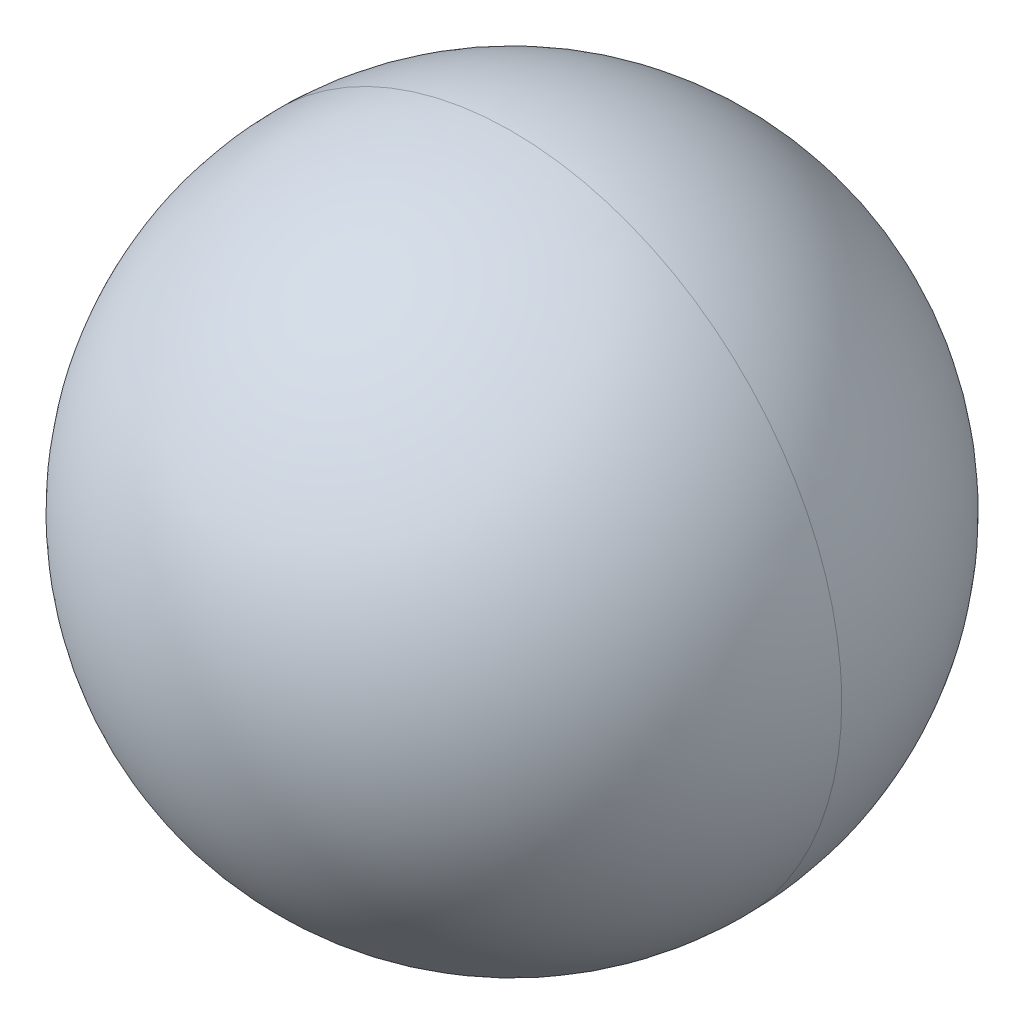
ISO-10303-21;
HEADER;
FILE_DESCRIPTION(('STEP AP214'),'2;1');
FILE_NAME('part.step','',(''),(''),'','','');
FILE_SCHEMA(('AUTOMOTIVE_DESIGN { 1 0 10303 214 1 1 1 1 }'));
ENDSEC;
DATA;
#1=APPLICATION_CONTEXT('core data for automotive mechanical design processes');
#2=APPLICATION_PROTOCOL_DEFINITION('international standard','automotive_design',2000,#1);
#3=PRODUCT_CONTEXT('',#1,'mechanical');
#4=PRODUCT('Part','Part','',(#3));
#5=PRODUCT_RELATED_PRODUCT_CATEGORY('part','',(#4));
#6=PRODUCT_DEFINITION_FORMATION('','',#4);
#7=PRODUCT_DEFINITION_CONTEXT('part definition',#1,'design');
#8=PRODUCT_DEFINITION('design','',#6,#7);
#9=PRODUCT_DEFINITION_SHAPE('','',#8);
#10=(LENGTH_UNIT() NAMED_UNIT(*) SI_UNIT(.MILLI.,.METRE.));
#11=(NAMED_UNIT(*) PLANE_ANGLE_UNIT() SI_UNIT($,.RADIAN.));
#12=(NAMED_UNIT(*) SI_UNIT($,.STERADIAN.) SOLID_ANGLE_UNIT());
#13=UNCERTAINTY_MEASURE_WITH_UNIT(LENGTH_MEASURE(1.E-05),#10,'distance_accuracy_value','');
#14=(GEOMETRIC_REPRESENTATION_CONTEXT(3) GLOBAL_UNCERTAINTY_ASSIGNED_CONTEXT((#13)) GLOBAL_UNIT_ASSIGNED_CONTEXT((#10,
#11,#12)) REPRESENTATION_CONTEXT('',''));
#15=CARTESIAN_POINT('',(0.,0.,0.));
#16=DIRECTION('',(0.,0.,1.));
#17=DIRECTION('',(1.,0.,0.));
#18=AXIS2_PLACEMENT_3D('',#15,#16,#17);
#19=CARTESIAN_POINT('',(3.5,15.375,0.));
#20=DIRECTION('',(1.,0.,0.));
#21=DIRECTION('',(0.,0.,1.));
#22=AXIS2_PLACEMENT_3D('',#19,#20,#21);
#23=SPHERICAL_SURFACE('',#22,1.75);
#24=CARTESIAN_POINT('',(3.5,15.375,0.));
#25=DIRECTION('',(0.,0.,1.));
#26=DIRECTION('',(0.,-1.,0.));
#27=AXIS2_PLACEMENT_3D('',#24,#25,#26);
#28=CIRCLE('',#27,1.75);
#29=CARTESIAN_POINT('',(1.75,15.375,0.));
#30=VERTEX_POINT('',#29);
#31=CARTESIAN_POINT('',(5.25,15.375,0.));
#32=VERTEX_POINT('',#31);
#33=EDGE_CURVE('E10',#30,#32,#28,.T.);
#34=ORIENTED_EDGE('',*,*,#33,.F.);
#35=CARTESIAN_POINT('',(1.75,15.375,0.));
#36=CARTESIAN_POINT('',(1.74999939259464,15.4036343369566,0.));
#37=CARTESIAN_POINT('',(1.75070277003098,15.4322686222289,0.));
#38=CARTESIAN_POINT('',(1.75351313325091,15.4894682379171,0.));
#39=CARTESIAN_POINT('',(1.75562011903451,15.518033568333,0.));
#40=CARTESIAN_POINT('',(1.7612333376128,15.5750264228205,0.));
#41=CARTESIAN_POINT('',(1.76473957040751,15.603453946892,0.));
#42=CARTESIAN_POINT('',(1.77314264471575,15.6601027137017,0.));
#43=CARTESIAN_POINT('',(1.77803948622929,15.6883239564399,0.));
#44=CARTESIAN_POINT('',(1.7892120323594,15.7444921706166,0.));
#45=CARTESIAN_POINT('',(1.79548773697598,15.7724391420552,0.));
#46=CARTESIAN_POINT('',(1.80940287684311,15.8279914876062,0.));
#47=CARTESIAN_POINT('',(1.81704231209367,15.8555968617186,0.));
#48=CARTESIAN_POINT('',(1.8336665128436,15.910399508672,0.));
#49=CARTESIAN_POINT('',(1.84265127834296,15.937596781513,0.));
#50=CARTESIAN_POINT('',(1.86194449351646,15.9915177053597,0.));
#51=CARTESIAN_POINT('',(1.87225294319059,16.0182413563654,0.));
#52=CARTESIAN_POINT('',(1.8941686930199,16.0711506569124,0.));
#53=CARTESIAN_POINT('',(1.90577599317508,16.0973363064537,0.));
#54=CARTESIAN_POINT('',(1.93026148089287,16.1491065205522,0.));
#55=CARTESIAN_POINT('',(1.94313966845548,16.1746910851094,0.));
#56=CARTESIAN_POINT('',(1.97013590632528,16.2251974937816,0.));
#57=CARTESIAN_POINT('',(1.98425395663247,16.2501193378967,0.));
#58=CARTESIAN_POINT('',(2.01369590836657,16.2992402667796,0.));
#59=CARTESIAN_POINT('',(2.02901980979348,16.3234393515475,0.));
#60=CARTESIAN_POINT('',(2.06083654714761,16.3710564640211,0.));
#61=CARTESIAN_POINT('',(2.07732938307484,16.3944744917269,0.));
#62=CARTESIAN_POINT('',(2.1114442567429,16.4404730739966,0.));
#63=CARTESIAN_POINT('',(2.12906629448374,16.4630536285604,0.));
#64=CARTESIAN_POINT('',(2.16539711874668,16.5073228660123,0.));
#65=CARTESIAN_POINT('',(2.1841059052688,16.5290115489004,0.));
#66=CARTESIAN_POINT('',(2.22256515598884,16.5714447930641,0.));
#67=CARTESIAN_POINT('',(2.24231562018678,16.5921893543397,0.));
#68=CARTESIAN_POINT('',(2.2828106456603,16.6326843798132,0.));
#69=CARTESIAN_POINT('',(2.30355520693588,16.6524348440112,0.));
#70=CARTESIAN_POINT('',(2.34598845109955,16.6908940947312,0.));
#71=CARTESIAN_POINT('',(2.36767713398765,16.7096028812533,0.));
#72=CARTESIAN_POINT('',(2.41194637143958,16.7459337055163,0.));
#73=CARTESIAN_POINT('',(2.43452692600342,16.7635557432571,0.));
#74=CARTESIAN_POINT('',(2.48052550827306,16.7976706169251,0.));
#75=CARTESIAN_POINT('',(2.50394353597886,16.8141634528523,0.));
#76=CARTESIAN_POINT('',(2.55156064845252,16.8459801902066,0.));
#77=CARTESIAN_POINT('',(2.57575973322038,16.8613040916337,0.));
#78=CARTESIAN_POINT('',(2.62488066210334,16.8907460433672,0.));
#79=CARTESIAN_POINT('',(2.64980250621845,16.9048640936736,0.));
#80=CARTESIAN_POINT('',(2.70030891489055,16.9318603315457,0.));
#81=CARTESIAN_POINT('',(2.72589347944755,16.9447385191115,0.));
#82=CARTESIAN_POINT('',(2.77766369354646,16.9692240068206,0.));
#83=CARTESIAN_POINT('',(2.80384934308838,16.980831306964,0.));
#84=CARTESIAN_POINT('',(2.8567586436338,17.0027470568255,0.));
#85=CARTESIAN_POINT('',(2.88348229463731,17.0130555065438,0.));
#86=CARTESIAN_POINT('',(2.93740321848992,17.0323487215968,0.));
#87=CARTESIAN_POINT('',(2.96460049133903,17.0413334869316,0.));
#88=CARTESIAN_POINT('',(3.01940313827035,17.0579576881311,0.));
#89=CARTESIAN_POINT('',(3.04700851235257,17.0655971239958,0.));
#90=CARTESIAN_POINT('',(3.102560857986,17.0795122621851,0.));
#91=CARTESIAN_POINT('',(3.13050782953722,17.0857879645096,0.));
#92=CARTESIAN_POINT('',(3.18667604340632,17.0969605169017,0.));
#93=CARTESIAN_POINT('',(3.21489728572421,17.1018573669694,0.));
#94=CARTESIAN_POINT('',(3.27154605368202,17.1102604179073,0.));
#95=CARTESIAN_POINT('',(3.29997357932194,17.1137666187775,0.));
#96=CARTESIAN_POINT('',(3.35696642952459,17.1193799245752,0.));
#97=CARTESIAN_POINT('',(3.38553175408733,17.1214870295029,0.));
#98=CARTESIAN_POINT('',(3.4427313857667,17.1242970672152,0.));
#99=CARTESIAN_POINT('',(3.47136569288335,17.125,0.));
#100=CARTESIAN_POINT('',(3.52863430711664,17.125,0.));
#101=CARTESIAN_POINT('',(3.55726861423329,17.1242970672152,0.));
#102=CARTESIAN_POINT('',(3.61446824591267,17.1214870295029,0.));
#103=CARTESIAN_POINT('',(3.6430335704754,17.1193799245752,0.));
#104=CARTESIAN_POINT('',(3.70002642067805,17.1137666187775,0.));
#105=CARTESIAN_POINT('',(3.72845394631798,17.1102604179073,0.));
#106=CARTESIAN_POINT('',(3.78510271427578,17.1018573669694,0.));
#107=CARTESIAN_POINT('',(3.81332395659367,17.0969605169017,0.));
#108=CARTESIAN_POINT('',(3.86949217046277,17.0857879645096,0.));
#109=CARTESIAN_POINT('',(3.89743914201399,17.0795122621851,0.));
#110=CARTESIAN_POINT('',(3.95299148764743,17.0655971239958,0.));
#111=CARTESIAN_POINT('',(3.98059686172964,17.0579576881311,0.));
#112=CARTESIAN_POINT('',(4.03539950866097,17.0413334869316,0.));
#113=CARTESIAN_POINT('',(4.06259678151008,17.0323487215968,0.));
#114=CARTESIAN_POINT('',(4.11651770536269,17.0130555065438,0.));
#115=CARTESIAN_POINT('',(4.14324135636619,17.0027470568255,0.));
#116=CARTESIAN_POINT('',(4.19615065691161,16.980831306964,0.));
#117=CARTESIAN_POINT('',(4.22233630645353,16.9692240068206,0.));
#118=CARTESIAN_POINT('',(4.27410652055245,16.9447385191115,0.));
#119=CARTESIAN_POINT('',(4.29969108510944,16.9318603315457,0.));
#120=CARTESIAN_POINT('',(4.35019749378154,16.9048640936736,0.));
#121=CARTESIAN_POINT('',(4.37511933789665,16.8907460433672,0.));
#122=CARTESIAN_POINT('',(4.42424026677962,16.8613040916337,0.));
#123=CARTESIAN_POINT('',(4.44843935154747,16.8459801902066,0.));
#124=CARTESIAN_POINT('',(4.49605646402113,16.8141634528523,0.));
#125=CARTESIAN_POINT('',(4.51947449172694,16.7976706169251,0.));
#126=CARTESIAN_POINT('',(4.56547307399657,16.7635557432571,0.));
#127=CARTESIAN_POINT('',(4.58805362856041,16.7459337055163,0.));
#128=CARTESIAN_POINT('',(4.63232286601234,16.7096028812533,0.));
#129=CARTESIAN_POINT('',(4.65401154890044,16.6908940947312,0.));
#130=CARTESIAN_POINT('',(4.69644479306412,16.6524348440112,0.));
#131=CARTESIAN_POINT('',(4.7171893543397,16.6326843798132,0.));
#132=CARTESIAN_POINT('',(4.75768437981321,16.5921893543397,0.));
#133=CARTESIAN_POINT('',(4.77743484401115,16.5714447930641,0.));
#134=CARTESIAN_POINT('',(4.8158940947312,16.5290115489004,0.));
#135=CARTESIAN_POINT('',(4.83460288125331,16.5073228660123,0.));
#136=CARTESIAN_POINT('',(4.87093370551626,16.4630536285604,0.));
#137=CARTESIAN_POINT('',(4.8885557432571,16.4404730739966,0.));
#138=CARTESIAN_POINT('',(4.92267061692516,16.3944744917269,0.));
#139=CARTESIAN_POINT('',(4.93916345285239,16.3710564640211,0.));
#140=CARTESIAN_POINT('',(4.97098019020652,16.3234393515475,0.));
#141=CARTESIAN_POINT('',(4.98630409163342,16.2992402667796,0.));
#142=CARTESIAN_POINT('',(5.01574604336752,16.2501193378967,0.));
#143=CARTESIAN_POINT('',(5.02986409367472,16.2251974937816,0.));
#144=CARTESIAN_POINT('',(5.05686033154452,16.1746910851094,0.));
#145=CARTESIAN_POINT('',(5.06973851910713,16.1491065205522,0.));
#146=CARTESIAN_POINT('',(5.09422400682492,16.0973363064538,0.));
#147=CARTESIAN_POINT('',(5.1058313069801,16.0711506569124,0.));
#148=CARTESIAN_POINT('',(5.1277470568094,16.0182413563654,0.));
#149=CARTESIAN_POINT('',(5.13805550648354,15.9915177053597,0.));
#150=CARTESIAN_POINT('',(5.15734872165703,15.937596781513,0.));
#151=CARTESIAN_POINT('',(5.1663334871564,15.910399508672,0.));
#152=CARTESIAN_POINT('',(5.18295768790633,15.8555968617186,0.));
#153=CARTESIAN_POINT('',(5.19059712315688,15.8279914876062,0.));
#154=CARTESIAN_POINT('',(5.20451226302402,15.7724391420552,0.));
#155=CARTESIAN_POINT('',(5.2107879676406,15.7444921706166,0.));
#156=CARTESIAN_POINT('',(5.22196051377071,15.6883239564399,0.));
#157=CARTESIAN_POINT('',(5.22685735528425,15.6601027137017,0.));
#158=CARTESIAN_POINT('',(5.23526042959249,15.603453946892,0.));
#159=CARTESIAN_POINT('',(5.23876666238719,15.5750264228205,0.));
#160=CARTESIAN_POINT('',(5.24437988096549,15.518033568333,0.));
#161=CARTESIAN_POINT('',(5.24648686674909,15.4894682379171,0.));
#162=CARTESIAN_POINT('',(5.24929722996902,15.4322686222289,0.));
#163=CARTESIAN_POINT('',(5.25000060740536,15.4036343369566,0.));
#164=CARTESIAN_POINT('',(5.25,15.375,0.));
#165=B_SPLINE_CURVE_WITH_KNOTS('',3,(#35,#36,#37,#38,#39,#40,#41,#42,#43,#44,#45,#46,#47,#48,
#49,#50,#51,#52,#53,#54,#55,#56,#57,#58,#59,#60,#61,#62,#63,#64,#65,#66,#67,#68,#69,#70,#71,#72,
#73,#74,#75,#76,#77,#78,#79,#80,#81,#82,#83,#84,#85,#86,#87,#88,#89,#90,#91,#92,#93,#94,#95,#96,
#97,#98,#99,#100,#101,#102,#103,#104,#105,#106,#107,#108,#109,#110,#111,#112,#113,#114,#115,
#116,#117,#118,#119,#120,#121,#122,#123,#124,#125,#126,#127,#128,#129,#130,#131,#132,#133,#134,
#135,#136,#137,#138,#139,#140,#141,#142,#143,#144,#145,#146,#147,#148,#149,#150,#151,#152,#153,
#154,#155,#156,#157,#158,#159,#160,#161,#162,#163,#164),.UNSPECIFIED.,.F.,.F.,(4,2,2,2,2,2,2,2,
2,2,2,2,2,2,2,2,2,2,2,2,2,2,2,2,2,2,2,2,2,2,2,2,2,2,2,2,2,2,2,2,2,2,2,2,2,2,2,2,2,2,2,2,2,2,2,2,
2,2,2,2,2,2,2,2,4),(0.,0.0858942998301933,0.171788599660386,0.25768289949058,0.343577199320772,
0.429471499150965,0.515365798981157,0.601260098811351,0.687154398641544,0.773048698471737,
0.858942998301929,0.944837298132123,1.03073159796232,1.11662589779251,1.2025201976227,
1.2884144974529,1.37430879728309,1.46020309711328,1.54609739694347,1.63199169677367,
1.71788599660386,1.80378029643405,1.88967459626424,1.97556889609444,2.06146319592463,
2.14735749575482,2.23325179558502,2.31914609541521,2.4050403952454,2.4909346950756,
2.57682899490579,2.66272329473598,2.74861759456617,2.83451189439637,2.92040619422656,
3.00630049405675,3.09219479388695,3.17808909371714,3.26398339354733,3.34987769337753,
3.43577199320772,3.52166629303791,3.6075605928681,3.6934548926983,3.77934919252849,
3.86524349235868,3.95113779218888,4.03703209201907,4.12292639184926,4.20882069167946,
4.29471499150965,4.38060929133984,4.46650359117003,4.55239789100023,4.63829219083042,
4.72418649066061,4.81008079049081,4.895975090321,4.98186939015119,5.06776368998139,
5.15365798981158,5.23955228964177,5.32544658947196,5.41134088930216,5.49723518913235),.UNSPECIFIED.);
#166=EDGE_CURVE('E25',#30,#32,#165,.T.);
#167=ORIENTED_EDGE('',*,*,#166,.T.);
#168=EDGE_LOOP('',(#34,#167));
#169=FACE_BOUND('',#168,.T.);
#170=ADVANCED_FACE('F16',(#169),#23,.T.);
#171=CARTESIAN_POINT('',(3.5,15.375,0.));
#172=DIRECTION('',(1.,0.,0.));
#173=DIRECTION('',(0.,0.,-1.));
#174=AXIS2_PLACEMENT_3D('',#171,#172,#173);
#175=SPHERICAL_SURFACE('',#174,1.75);
#176=ORIENTED_EDGE('',*,*,#33,.T.);
#177=ORIENTED_EDGE('',*,*,#166,.F.);
#178=EDGE_LOOP('',(#176,#177));
#179=FACE_BOUND('',#178,.T.);
#180=ADVANCED_FACE('F35',(#179),#175,.T.);
#181=CLOSED_SHELL('',(#170,#180));
#182=MANIFOLD_SOLID_BREP('B1',#181);
#183=ADVANCED_BREP_SHAPE_REPRESENTATION('',(#18,#182),#14);
#184=SHAPE_DEFINITION_REPRESENTATION(#9,#183);
ENDSEC;
END-ISO-10303-21;
